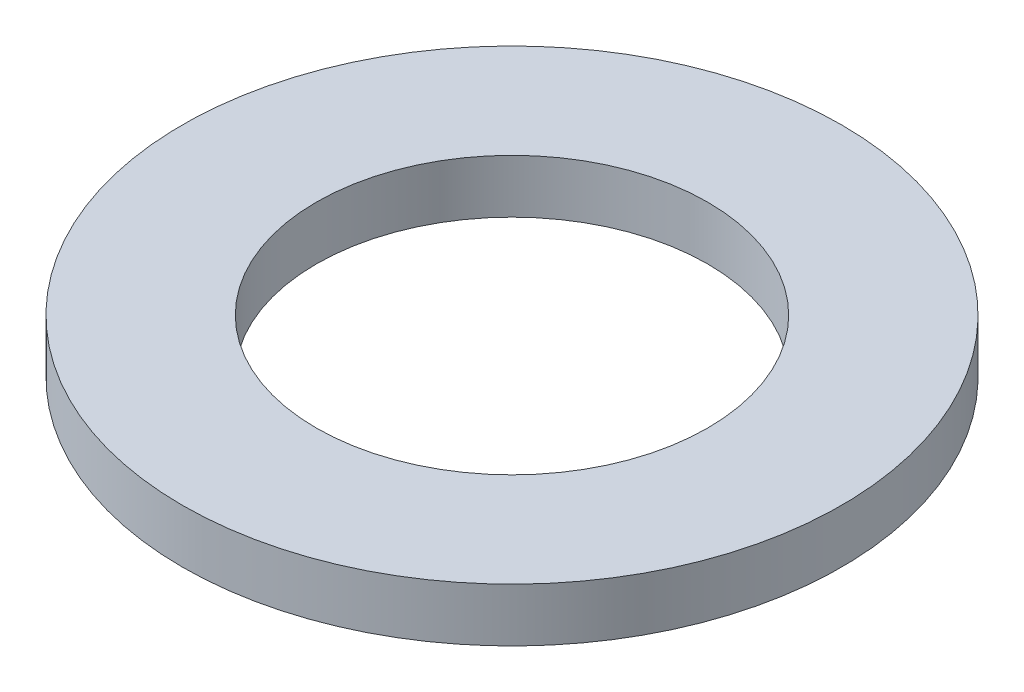
ISO-10303-21;
HEADER;
FILE_DESCRIPTION(('STEP AP214'),'2;1');
FILE_NAME('part.step','',(''),(''),'','','');
FILE_SCHEMA(('AUTOMOTIVE_DESIGN { 1 0 10303 214 1 1 1 1 }'));
ENDSEC;
DATA;
#1=APPLICATION_CONTEXT('core data for automotive mechanical design processes');
#2=APPLICATION_PROTOCOL_DEFINITION('international standard','automotive_design',2000,#1);
#3=PRODUCT_CONTEXT('',#1,'mechanical');
#4=PRODUCT('Part','Part','',(#3));
#5=PRODUCT_RELATED_PRODUCT_CATEGORY('part','',(#4));
#6=PRODUCT_DEFINITION_FORMATION('','',#4);
#7=PRODUCT_DEFINITION_CONTEXT('part definition',#1,'design');
#8=PRODUCT_DEFINITION('design','',#6,#7);
#9=PRODUCT_DEFINITION_SHAPE('','',#8);
#10=(LENGTH_UNIT() NAMED_UNIT(*) SI_UNIT(.MILLI.,.METRE.));
#11=(NAMED_UNIT(*) PLANE_ANGLE_UNIT() SI_UNIT($,.RADIAN.));
#12=(NAMED_UNIT(*) SI_UNIT($,.STERADIAN.) SOLID_ANGLE_UNIT());
#13=UNCERTAINTY_MEASURE_WITH_UNIT(LENGTH_MEASURE(1.E-05),#10,'distance_accuracy_value','');
#14=(GEOMETRIC_REPRESENTATION_CONTEXT(3) GLOBAL_UNCERTAINTY_ASSIGNED_CONTEXT((#13)) GLOBAL_UNIT_ASSIGNED_CONTEXT((#10,
#11,#12)) REPRESENTATION_CONTEXT('',''));
#15=CARTESIAN_POINT('',(0.,0.,0.));
#16=DIRECTION('',(0.,0.,1.));
#17=DIRECTION('',(1.,0.,0.));
#18=AXIS2_PLACEMENT_3D('',#15,#16,#17);
#19=CARTESIAN_POINT('',(0.,13.,0.));
#20=DIRECTION('',(0.,-1.,0.));
#21=DIRECTION('',(0.,0.,-1.));
#22=AXIS2_PLACEMENT_3D('',#19,#20,#21);
#23=CYLINDRICAL_SURFACE('',#22,80.);
#24=CARTESIAN_POINT('',(0.,13.,0.));
#25=DIRECTION('',(0.,1.,0.));
#26=DIRECTION('',(0.,0.,1.));
#27=AXIS2_PLACEMENT_3D('',#24,#25,#26);
#28=CIRCLE('',#27,80.);
#29=CARTESIAN_POINT('',(0.,13.,-80.));
#30=VERTEX_POINT('',#29);
#31=EDGE_CURVE('E10',#30,#30,#28,.T.);
#32=CARTESIAN_POINT('',(0.,0.,0.));
#33=DIRECTION('',(0.,1.,0.));
#34=DIRECTION('',(0.,0.,1.));
#35=AXIS2_PLACEMENT_3D('',#32,#33,#34);
#36=CIRCLE('',#35,80.);
#37=CARTESIAN_POINT('',(0.,0.,-80.));
#38=VERTEX_POINT('',#37);
#39=EDGE_CURVE('E37',#38,#38,#36,.T.);
#40=CARTESIAN_POINT('',(0.,13.,-80.));
#41=CARTESIAN_POINT('',(0.,12.8645833333333,-80.));
#42=CARTESIAN_POINT('',(0.,12.7291666666667,-80.));
#43=CARTESIAN_POINT('',(0.,12.4583333333333,-80.));
#44=CARTESIAN_POINT('',(0.,12.3229166666667,-80.));
#45=CARTESIAN_POINT('',(0.,12.0520833333333,-80.));
#46=CARTESIAN_POINT('',(0.,11.9166666666667,-80.));
#47=CARTESIAN_POINT('',(0.,11.6458333333333,-80.));
#48=CARTESIAN_POINT('',(0.,11.5104166666667,-80.));
#49=CARTESIAN_POINT('',(0.,11.2395833333333,-80.));
#50=CARTESIAN_POINT('',(0.,11.1041666666667,-80.));
#51=CARTESIAN_POINT('',(0.,10.8333333333333,-80.));
#52=CARTESIAN_POINT('',(0.,10.6979166666667,-80.));
#53=CARTESIAN_POINT('',(0.,10.4270833333333,-80.));
#54=CARTESIAN_POINT('',(0.,10.2916666666667,-80.));
#55=CARTESIAN_POINT('',(0.,10.0208333333333,-80.));
#56=CARTESIAN_POINT('',(0.,9.88541666666667,-80.));
#57=CARTESIAN_POINT('',(0.,9.61458333333333,-80.));
#58=CARTESIAN_POINT('',(0.,9.47916666666667,-80.));
#59=CARTESIAN_POINT('',(0.,9.20833333333333,-80.));
#60=CARTESIAN_POINT('',(0.,9.07291666666667,-80.));
#61=CARTESIAN_POINT('',(0.,8.80208333333333,-80.));
#62=CARTESIAN_POINT('',(0.,8.66666666666667,-80.));
#63=CARTESIAN_POINT('',(0.,8.39583333333333,-80.));
#64=CARTESIAN_POINT('',(0.,8.26041666666667,-80.));
#65=CARTESIAN_POINT('',(0.,7.98958333333333,-80.));
#66=CARTESIAN_POINT('',(0.,7.85416666666667,-80.));
#67=CARTESIAN_POINT('',(0.,7.58333333333333,-80.));
#68=CARTESIAN_POINT('',(0.,7.44791666666667,-80.));
#69=CARTESIAN_POINT('',(0.,7.17708333333333,-80.));
#70=CARTESIAN_POINT('',(0.,7.04166666666667,-80.));
#71=CARTESIAN_POINT('',(0.,6.77083333333333,-80.));
#72=CARTESIAN_POINT('',(0.,6.63541666666667,-80.));
#73=CARTESIAN_POINT('',(0.,6.36458333333333,-80.));
#74=CARTESIAN_POINT('',(0.,6.22916666666667,-80.));
#75=CARTESIAN_POINT('',(0.,5.95833333333333,-80.));
#76=CARTESIAN_POINT('',(0.,5.82291666666667,-80.));
#77=CARTESIAN_POINT('',(0.,5.55208333333333,-80.));
#78=CARTESIAN_POINT('',(0.,5.41666666666667,-80.));
#79=CARTESIAN_POINT('',(0.,5.14583333333333,-80.));
#80=CARTESIAN_POINT('',(0.,5.01041666666667,-80.));
#81=CARTESIAN_POINT('',(0.,4.73958333333333,-80.));
#82=CARTESIAN_POINT('',(0.,4.60416666666667,-80.));
#83=CARTESIAN_POINT('',(0.,4.33333333333333,-80.));
#84=CARTESIAN_POINT('',(0.,4.19791666666667,-80.));
#85=CARTESIAN_POINT('',(0.,3.92708333333333,-80.));
#86=CARTESIAN_POINT('',(0.,3.79166666666667,-80.));
#87=CARTESIAN_POINT('',(0.,3.52083333333333,-80.));
#88=CARTESIAN_POINT('',(0.,3.38541666666667,-80.));
#89=CARTESIAN_POINT('',(0.,3.11458333333333,-80.));
#90=CARTESIAN_POINT('',(0.,2.97916666666667,-80.));
#91=CARTESIAN_POINT('',(0.,2.70833333333333,-80.));
#92=CARTESIAN_POINT('',(0.,2.57291666666667,-80.));
#93=CARTESIAN_POINT('',(0.,2.30208333333333,-80.));
#94=CARTESIAN_POINT('',(0.,2.16666666666667,-80.));
#95=CARTESIAN_POINT('',(0.,1.89583333333333,-80.));
#96=CARTESIAN_POINT('',(0.,1.76041666666667,-80.));
#97=CARTESIAN_POINT('',(0.,1.48958333333333,-80.));
#98=CARTESIAN_POINT('',(0.,1.35416666666667,-80.));
#99=CARTESIAN_POINT('',(0.,1.08333333333333,-80.));
#100=CARTESIAN_POINT('',(0.,0.947916666666667,-80.));
#101=CARTESIAN_POINT('',(0.,0.677083333333334,-80.));
#102=CARTESIAN_POINT('',(0.,0.541666666666667,-80.));
#103=CARTESIAN_POINT('',(0.,0.270833333333334,-80.));
#104=CARTESIAN_POINT('',(0.,0.135416666666667,-80.));
#105=CARTESIAN_POINT('',(0.,0.,-80.));
#106=B_SPLINE_CURVE_WITH_KNOTS('',3,(#40,#41,#42,#43,#44,#45,#46,#47,#48,#49,#50,#51,#52,#53,
#54,#55,#56,#57,#58,#59,#60,#61,#62,#63,#64,#65,#66,#67,#68,#69,#70,#71,#72,#73,#74,#75,#76,#77,
#78,#79,#80,#81,#82,#83,#84,#85,#86,#87,#88,#89,#90,#91,#92,#93,#94,#95,#96,#97,#98,#99,#100,
#101,#102,#103,#104,#105),.UNSPECIFIED.,.F.,.F.,(4,2,2,2,2,2,2,2,2,2,2,2,2,2,2,2,2,2,2,2,2,2,2,
2,2,2,2,2,2,2,2,2,4),(0.,0.406249999999999,0.812499999999999,1.21875,1.625,2.03125,2.4375,
2.84375,3.25,3.65625,4.0625,4.46875,4.875,5.28125,5.6875,6.09375,6.5,6.90625,7.3125,7.71875,
8.125,8.53125,8.9375,9.34375,9.75,10.15625,10.5625,10.96875,11.375,11.78125,12.1875,12.59375,
13.),.UNSPECIFIED.);
#107=EDGE_CURVE('BSEAM40',#30,#38,#106,.T.);
#108=ORIENTED_EDGE('',*,*,#31,.F.);
#109=ORIENTED_EDGE('',*,*,#39,.T.);
#110=ORIENTED_EDGE('',*,*,#107,.T.);
#111=ORIENTED_EDGE('',*,*,#107,.F.);
#112=EDGE_LOOP('',(#108,#110,#109,#111));
#113=FACE_BOUND('',#112,.T.);
#114=ADVANCED_FACE('F40',(#113),#23,.T.);
#115=CARTESIAN_POINT('',(0.,13.,0.));
#116=DIRECTION('',(0.,1.,0.));
#117=DIRECTION('',(0.,0.,1.));
#118=AXIS2_PLACEMENT_3D('',#115,#116,#117);
#119=PLANE('',#118);
#120=CARTESIAN_POINT('',(0.,13.,0.));
#121=DIRECTION('',(0.,1.,0.));
#122=DIRECTION('',(0.,0.,1.));
#123=AXIS2_PLACEMENT_3D('',#120,#121,#122);
#124=CIRCLE('',#123,47.5);
#125=CARTESIAN_POINT('',(0.,13.,-47.5));
#126=VERTEX_POINT('',#125);
#127=EDGE_CURVE('E50',#126,#126,#124,.T.);
#128=ORIENTED_EDGE('',*,*,#127,.F.);
#129=EDGE_LOOP('',(#128));
#130=FACE_BOUND('',#129,.T.);
#131=ORIENTED_EDGE('',*,*,#31,.T.);
#132=EDGE_LOOP('',(#131));
#133=FACE_BOUND('',#132,.T.);
#134=ADVANCED_FACE('F59',(#130,#133),#119,.T.);
#135=CARTESIAN_POINT('',(0.,0.,0.));
#136=DIRECTION('',(0.,1.,0.));
#137=DIRECTION('',(0.,0.,1.));
#138=AXIS2_PLACEMENT_3D('',#135,#136,#137);
#139=PLANE('',#138);
#140=CARTESIAN_POINT('',(0.,0.,0.));
#141=DIRECTION('',(0.,1.,0.));
#142=DIRECTION('',(0.,0.,1.));
#143=AXIS2_PLACEMENT_3D('',#140,#141,#142);
#144=CIRCLE('',#143,47.5);
#145=CARTESIAN_POINT('',(0.,0.,-47.5));
#146=VERTEX_POINT('',#145);
#147=EDGE_CURVE('E47',#146,#146,#144,.T.);
#148=ORIENTED_EDGE('',*,*,#147,.T.);
#149=EDGE_LOOP('',(#148));
#150=FACE_BOUND('',#149,.T.);
#151=ORIENTED_EDGE('',*,*,#39,.F.);
#152=EDGE_LOOP('',(#151));
#153=FACE_BOUND('',#152,.T.);
#154=ADVANCED_FACE('F58',(#150,#153),#139,.F.);
#155=CARTESIAN_POINT('',(0.,13.,0.));
#156=DIRECTION('',(0.,-1.,0.));
#157=DIRECTION('',(0.,0.,-1.));
#158=AXIS2_PLACEMENT_3D('',#155,#156,#157);
#159=CYLINDRICAL_SURFACE('',#158,47.5);
#160=CARTESIAN_POINT('',(0.,13.,-47.5));
#161=CARTESIAN_POINT('',(0.,12.8645833333333,-47.5));
#162=CARTESIAN_POINT('',(0.,12.7291666666667,-47.5));
#163=CARTESIAN_POINT('',(0.,12.4583333333333,-47.5));
#164=CARTESIAN_POINT('',(0.,12.3229166666667,-47.5));
#165=CARTESIAN_POINT('',(0.,12.0520833333333,-47.5));
#166=CARTESIAN_POINT('',(0.,11.9166666666667,-47.5));
#167=CARTESIAN_POINT('',(0.,11.6458333333333,-47.5));
#168=CARTESIAN_POINT('',(0.,11.5104166666667,-47.5));
#169=CARTESIAN_POINT('',(0.,11.2395833333333,-47.5));
#170=CARTESIAN_POINT('',(0.,11.1041666666667,-47.5));
#171=CARTESIAN_POINT('',(0.,10.8333333333333,-47.5));
#172=CARTESIAN_POINT('',(0.,10.6979166666667,-47.5));
#173=CARTESIAN_POINT('',(0.,10.4270833333333,-47.5));
#174=CARTESIAN_POINT('',(0.,10.2916666666667,-47.5));
#175=CARTESIAN_POINT('',(0.,10.0208333333333,-47.5));
#176=CARTESIAN_POINT('',(0.,9.88541666666667,-47.5));
#177=CARTESIAN_POINT('',(0.,9.61458333333333,-47.5));
#178=CARTESIAN_POINT('',(0.,9.47916666666667,-47.5));
#179=CARTESIAN_POINT('',(0.,9.20833333333333,-47.5));
#180=CARTESIAN_POINT('',(0.,9.07291666666666,-47.5));
#181=CARTESIAN_POINT('',(0.,8.80208333333333,-47.5));
#182=CARTESIAN_POINT('',(0.,8.66666666666667,-47.5));
#183=CARTESIAN_POINT('',(0.,8.39583333333333,-47.5));
#184=CARTESIAN_POINT('',(0.,8.26041666666667,-47.5));
#185=CARTESIAN_POINT('',(0.,7.98958333333333,-47.5));
#186=CARTESIAN_POINT('',(0.,7.85416666666667,-47.5));
#187=CARTESIAN_POINT('',(0.,7.58333333333333,-47.5));
#188=CARTESIAN_POINT('',(0.,7.44791666666667,-47.5));
#189=CARTESIAN_POINT('',(0.,7.17708333333333,-47.5));
#190=CARTESIAN_POINT('',(0.,7.04166666666667,-47.5));
#191=CARTESIAN_POINT('',(0.,6.77083333333333,-47.5));
#192=CARTESIAN_POINT('',(0.,6.63541666666667,-47.5));
#193=CARTESIAN_POINT('',(0.,6.36458333333333,-47.5));
#194=CARTESIAN_POINT('',(0.,6.22916666666667,-47.5));
#195=CARTESIAN_POINT('',(0.,5.95833333333333,-47.5));
#196=CARTESIAN_POINT('',(0.,5.82291666666667,-47.5));
#197=CARTESIAN_POINT('',(0.,5.55208333333333,-47.5));
#198=CARTESIAN_POINT('',(0.,5.41666666666667,-47.5));
#199=CARTESIAN_POINT('',(0.,5.14583333333333,-47.5));
#200=CARTESIAN_POINT('',(0.,5.01041666666667,-47.5));
#201=CARTESIAN_POINT('',(0.,4.73958333333333,-47.5));
#202=CARTESIAN_POINT('',(0.,4.60416666666667,-47.5));
#203=CARTESIAN_POINT('',(0.,4.33333333333333,-47.5));
#204=CARTESIAN_POINT('',(0.,4.19791666666667,-47.5));
#205=CARTESIAN_POINT('',(0.,3.92708333333333,-47.5));
#206=CARTESIAN_POINT('',(0.,3.79166666666667,-47.5));
#207=CARTESIAN_POINT('',(0.,3.52083333333333,-47.5));
#208=CARTESIAN_POINT('',(0.,3.38541666666667,-47.5));
#209=CARTESIAN_POINT('',(0.,3.11458333333333,-47.5));
#210=CARTESIAN_POINT('',(0.,2.97916666666667,-47.5));
#211=CARTESIAN_POINT('',(0.,2.70833333333333,-47.5));
#212=CARTESIAN_POINT('',(0.,2.57291666666667,-47.5));
#213=CARTESIAN_POINT('',(0.,2.30208333333333,-47.5));
#214=CARTESIAN_POINT('',(0.,2.16666666666667,-47.5));
#215=CARTESIAN_POINT('',(0.,1.89583333333333,-47.5));
#216=CARTESIAN_POINT('',(0.,1.76041666666667,-47.5));
#217=CARTESIAN_POINT('',(0.,1.48958333333333,-47.5));
#218=CARTESIAN_POINT('',(0.,1.35416666666667,-47.5));
#219=CARTESIAN_POINT('',(0.,1.08333333333333,-47.5));
#220=CARTESIAN_POINT('',(0.,0.947916666666667,-47.5));
#221=CARTESIAN_POINT('',(0.,0.677083333333334,-47.5));
#222=CARTESIAN_POINT('',(0.,0.541666666666667,-47.5));
#223=CARTESIAN_POINT('',(0.,0.270833333333334,-47.5));
#224=CARTESIAN_POINT('',(0.,0.135416666666667,-47.5));
#225=CARTESIAN_POINT('',(0.,0.,-47.5));
#226=B_SPLINE_CURVE_WITH_KNOTS('',3,(#160,#161,#162,#163,#164,#165,#166,#167,#168,#169,#170,
#171,#172,#173,#174,#175,#176,#177,#178,#179,#180,#181,#182,#183,#184,#185,#186,#187,#188,#189,
#190,#191,#192,#193,#194,#195,#196,#197,#198,#199,#200,#201,#202,#203,#204,#205,#206,#207,#208,
#209,#210,#211,#212,#213,#214,#215,#216,#217,#218,#219,#220,#221,#222,#223,#224,#225),
.UNSPECIFIED.,.F.,.F.,(4,2,2,2,2,2,2,2,2,2,2,2,2,2,2,2,2,2,2,2,2,2,2,2,2,2,2,2,2,2,2,2,4),(0.,
0.40625,0.812500000000001,1.21875,1.625,2.03125,2.4375,2.84375,3.25,3.65625,4.0625,4.46875,
4.875,5.28125,5.6875,6.09375,6.5,6.90625,7.3125,7.71875,8.125,8.53125,8.9375,9.34375,9.75,
10.15625,10.5625,10.96875,11.375,11.78125,12.1875,12.59375,13.),.UNSPECIFIED.);
#227=EDGE_CURVE('BSEAM54',#126,#146,#226,.T.);
#228=ORIENTED_EDGE('',*,*,#127,.T.);
#229=ORIENTED_EDGE('',*,*,#147,.F.);
#230=ORIENTED_EDGE('',*,*,#227,.T.);
#231=ORIENTED_EDGE('',*,*,#227,.F.);
#232=EDGE_LOOP('',(#228,#230,#229,#231));
#233=FACE_BOUND('',#232,.T.);
#234=ADVANCED_FACE('F54',(#233),#159,.F.);
#235=CLOSED_SHELL('',(#114,#134,#154,#234));
#236=MANIFOLD_SOLID_BREP('B2',#235);
#237=ADVANCED_BREP_SHAPE_REPRESENTATION('',(#18,#236),#14);
#238=SHAPE_DEFINITION_REPRESENTATION(#9,#237);
ENDSEC;
END-ISO-10303-21;
